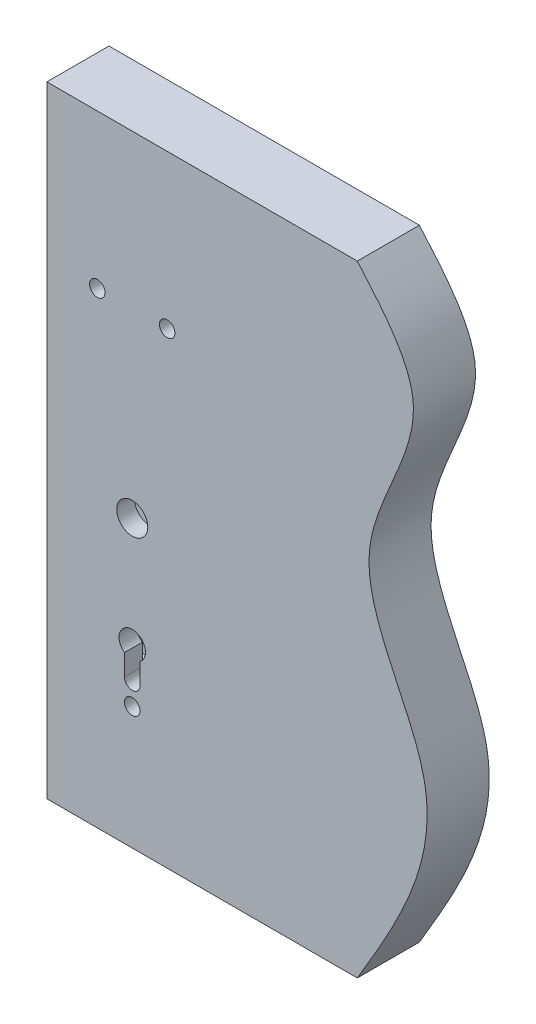
ISO-10303-21;
HEADER;
FILE_DESCRIPTION(('STEP AP214'),'2;1');
FILE_NAME('part.step','',(''),(''),'','','');
FILE_SCHEMA(('AUTOMOTIVE_DESIGN { 1 0 10303 214 1 1 1 1 }'));
ENDSEC;
DATA;
#1=APPLICATION_CONTEXT('core data for automotive mechanical design processes');
#2=APPLICATION_PROTOCOL_DEFINITION('international standard','automotive_design',2000,#1);
#3=PRODUCT_CONTEXT('',#1,'mechanical');
#4=PRODUCT('Part','Part','',(#3));
#5=PRODUCT_RELATED_PRODUCT_CATEGORY('part','',(#4));
#6=PRODUCT_DEFINITION_FORMATION('','',#4);
#7=PRODUCT_DEFINITION_CONTEXT('part definition',#1,'design');
#8=PRODUCT_DEFINITION('design','',#6,#7);
#9=PRODUCT_DEFINITION_SHAPE('','',#8);
#10=(LENGTH_UNIT() NAMED_UNIT(*) SI_UNIT(.MILLI.,.METRE.));
#11=(NAMED_UNIT(*) PLANE_ANGLE_UNIT() SI_UNIT($,.RADIAN.));
#12=(NAMED_UNIT(*) SI_UNIT($,.STERADIAN.) SOLID_ANGLE_UNIT());
#13=UNCERTAINTY_MEASURE_WITH_UNIT(LENGTH_MEASURE(1.E-05),#10,'distance_accuracy_value','');
#14=(GEOMETRIC_REPRESENTATION_CONTEXT(3) GLOBAL_UNCERTAINTY_ASSIGNED_CONTEXT((#13)) GLOBAL_UNIT_ASSIGNED_CONTEXT((#10,
#11,#12)) REPRESENTATION_CONTEXT('',''));
#15=CARTESIAN_POINT('',(0.,0.,0.));
#16=DIRECTION('',(0.,0.,1.));
#17=DIRECTION('',(1.,0.,0.));
#18=AXIS2_PLACEMENT_3D('',#15,#16,#17);
#19=CARTESIAN_POINT('',(-147.,-116.5,-8.5));
#20=DIRECTION('',(0.,-1.,0.));
#21=DIRECTION('',(1.,0.,0.));
#22=AXIS2_PLACEMENT_3D('',#19,#20,#21);
#23=PLANE('',#22);
#24=DIRECTION('',(1.,0.,0.));
#25=VECTOR('',#24,1.);
#26=CARTESIAN_POINT('',(-147.,-116.5,-8.5));
#27=LINE('',#26,#25);
#28=CARTESIAN_POINT('',(-92.8205505282296,-116.5,-8.5));
#29=VERTEX_POINT('',#28);
#30=CARTESIAN_POINT('',(-70.,-116.5,-8.5));
#31=VERTEX_POINT('',#30);
#32=EDGE_CURVE('E280',#29,#31,#27,.T.);
#33=ORIENTED_EDGE('',*,*,#32,.F.);
#34=DIRECTION('',(0.,0.,1.));
#35=VECTOR('',#34,1.);
#36=CARTESIAN_POINT('',(-92.8205505282296,-116.5,-20.));
#37=LINE('',#36,#35);
#38=CARTESIAN_POINT('',(-92.8205505282296,-116.5,8.5));
#39=VERTEX_POINT('',#38);
#40=EDGE_CURVE('E254',#29,#39,#37,.T.);
#41=ORIENTED_EDGE('',*,*,#40,.T.);
#42=DIRECTION('',(1.,0.,0.));
#43=VECTOR('',#42,1.);
#44=CARTESIAN_POINT('',(-147.,-116.5,8.5));
#45=LINE('',#44,#43);
#46=CARTESIAN_POINT('',(-70.,-116.5,8.5));
#47=VERTEX_POINT('',#46);
#48=EDGE_CURVE('E275',#39,#47,#45,.T.);
#49=ORIENTED_EDGE('',*,*,#48,.T.);
#50=DIRECTION('',(0.,0.,1.));
#51=VECTOR('',#50,1.);
#52=CARTESIAN_POINT('',(-70.,-116.5,-8.5));
#53=LINE('',#52,#51);
#54=EDGE_CURVE('E289',#31,#47,#53,.T.);
#55=ORIENTED_EDGE('',*,*,#54,.F.);
#56=EDGE_LOOP('',(#33,#41,#49,#55));
#57=FACE_BOUND('',#56,.T.);
#58=ADVANCED_FACE('F35',(#57),#23,.F.);
#59=CARTESIAN_POINT('',(-147.,-150.,-11.));
#60=DIRECTION('',(-1.,0.,0.));
#61=DIRECTION('',(0.,0.,1.));
#62=AXIS2_PLACEMENT_3D('',#59,#60,#61);
#63=PLANE('',#62);
#64=DIRECTION('',(0.,-1.,0.));
#65=VECTOR('',#64,1.);
#66=CARTESIAN_POINT('',(-147.,80.,-11.));
#67=LINE('',#66,#65);
#68=CARTESIAN_POINT('',(-147.,80.,-11.));
#69=VERTEX_POINT('',#68);
#70=CARTESIAN_POINT('',(-147.,-150.,-11.));
#71=VERTEX_POINT('',#70);
#72=EDGE_CURVE('E312',#69,#71,#67,.T.);
#73=ORIENTED_EDGE('',*,*,#72,.T.);
#74=DIRECTION('',(0.,0.,1.));
#75=VECTOR('',#74,1.);
#76=CARTESIAN_POINT('',(-147.,-150.,-11.));
#77=LINE('',#76,#75);
#78=CARTESIAN_POINT('',(-147.,-150.,11.));
#79=VERTEX_POINT('',#78);
#80=EDGE_CURVE('E315',#71,#79,#77,.T.);
#81=ORIENTED_EDGE('',*,*,#80,.T.);
#82=DIRECTION('',(0.,1.,0.));
#83=VECTOR('',#82,1.);
#84=CARTESIAN_POINT('',(-147.,80.,11.));
#85=LINE('',#84,#83);
#86=CARTESIAN_POINT('',(-147.,80.,11.));
#87=VERTEX_POINT('',#86);
#88=EDGE_CURVE('E319',#79,#87,#85,.T.);
#89=ORIENTED_EDGE('',*,*,#88,.T.);
#90=DIRECTION('',(0.,0.,-1.));
#91=VECTOR('',#90,1.);
#92=CARTESIAN_POINT('',(-147.,80.,-11.));
#93=LINE('',#92,#91);
#94=EDGE_CURVE('E322',#87,#69,#93,.T.);
#95=ORIENTED_EDGE('',*,*,#94,.T.);
#96=EDGE_LOOP('',(#73,#81,#89,#95));
#97=FACE_BOUND('',#96,.T.);
#98=DIRECTION('',(0.,0.,1.));
#99=VECTOR('',#98,1.);
#100=CARTESIAN_POINT('',(-147.,-116.5,-8.5));
#101=LINE('',#100,#99);
#102=CARTESIAN_POINT('',(-147.,-116.5,-8.5));
#103=VERTEX_POINT('',#102);
#104=CARTESIAN_POINT('',(-147.,-116.5,8.5));
#105=VERTEX_POINT('',#104);
#106=EDGE_CURVE('E301',#103,#105,#101,.T.);
#107=ORIENTED_EDGE('',*,*,#106,.F.);
#108=DIRECTION('',(0.,-1.,0.));
#109=VECTOR('',#108,1.);
#110=CARTESIAN_POINT('',(-147.,-116.5,-8.5));
#111=LINE('',#110,#109);
#112=CARTESIAN_POINT('',(-147.,46.5,-8.5));
#113=VERTEX_POINT('',#112);
#114=EDGE_CURVE('E286',#113,#103,#111,.T.);
#115=ORIENTED_EDGE('',*,*,#114,.F.);
#116=DIRECTION('',(0.,0.,1.));
#117=VECTOR('',#116,1.);
#118=CARTESIAN_POINT('',(-147.,46.5,-8.5));
#119=LINE('',#118,#117);
#120=CARTESIAN_POINT('',(-147.,46.5,8.5));
#121=VERTEX_POINT('',#120);
#122=EDGE_CURVE('E305',#113,#121,#119,.T.);
#123=ORIENTED_EDGE('',*,*,#122,.T.);
#124=DIRECTION('',(0.,-1.,0.));
#125=VECTOR('',#124,1.);
#126=CARTESIAN_POINT('',(-147.,-116.5,8.5));
#127=LINE('',#126,#125);
#128=EDGE_CURVE('E298',#121,#105,#127,.T.);
#129=ORIENTED_EDGE('',*,*,#128,.T.);
#130=EDGE_LOOP('',(#107,#115,#123,#129));
#131=FACE_BOUND('',#130,.T.);
#132=ADVANCED_FACE('F373',(#97,#131),#63,.T.);
#133=CARTESIAN_POINT('',(-150.,200.,20.));
#134=DIRECTION('',(1.,0.,0.));
#135=DIRECTION('',(0.,0.,-1.));
#136=AXIS2_PLACEMENT_3D('',#133,#134,#135);
#137=PLANE('',#136);
#138=DIRECTION('',(0.,0.,1.));
#139=VECTOR('',#138,1.);
#140=CARTESIAN_POINT('',(-150.,-150.,-11.));
#141=LINE('',#140,#139);
#142=CARTESIAN_POINT('',(-150.,-150.,-11.));
#143=VERTEX_POINT('',#142);
#144=CARTESIAN_POINT('',(-150.,-150.,11.));
#145=VERTEX_POINT('',#144);
#146=EDGE_CURVE('E327',#143,#145,#141,.T.);
#147=ORIENTED_EDGE('',*,*,#146,.F.);
#148=DIRECTION('',(0.,-1.,0.));
#149=VECTOR('',#148,1.);
#150=CARTESIAN_POINT('',(-150.,80.,-11.));
#151=LINE('',#150,#149);
#152=CARTESIAN_POINT('',(-150.,80.,-11.));
#153=VERTEX_POINT('',#152);
#154=EDGE_CURVE('E304',#153,#143,#151,.T.);
#155=ORIENTED_EDGE('',*,*,#154,.F.);
#156=DIRECTION('',(0.,0.,-1.));
#157=VECTOR('',#156,1.);
#158=CARTESIAN_POINT('',(-150.,80.,-11.));
#159=LINE('',#158,#157);
#160=CARTESIAN_POINT('',(-150.,80.,11.));
#161=VERTEX_POINT('',#160);
#162=EDGE_CURVE('E316',#161,#153,#159,.T.);
#163=ORIENTED_EDGE('',*,*,#162,.F.);
#164=DIRECTION('',(0.,1.,0.));
#165=VECTOR('',#164,1.);
#166=CARTESIAN_POINT('',(-150.,80.,11.));
#167=LINE('',#166,#165);
#168=EDGE_CURVE('E330',#145,#161,#167,.T.);
#169=ORIENTED_EDGE('',*,*,#168,.F.);
#170=EDGE_LOOP('',(#147,#155,#163,#169));
#171=FACE_BOUND('',#170,.T.);
#172=DIRECTION('',(0.,-1.,0.));
#173=VECTOR('',#172,1.);
#174=CARTESIAN_POINT('',(-150.,200.,-20.));
#175=LINE('',#174,#173);
#176=CARTESIAN_POINT('',(-150.,200.,-20.));
#177=VERTEX_POINT('',#176);
#178=CARTESIAN_POINT('',(-150.,-200.,-20.));
#179=VERTEX_POINT('',#178);
#180=EDGE_CURVE('E337',#177,#179,#175,.T.);
#181=ORIENTED_EDGE('',*,*,#180,.T.);
#182=DIRECTION('',(0.,0.,-1.));
#183=VECTOR('',#182,1.);
#184=CARTESIAN_POINT('',(-150.,-200.,20.));
#185=LINE('',#184,#183);
#186=CARTESIAN_POINT('',(-150.,-200.,20.));
#187=VERTEX_POINT('',#186);
#188=EDGE_CURVE('E411',#187,#179,#185,.T.);
#189=ORIENTED_EDGE('',*,*,#188,.F.);
#190=DIRECTION('',(0.,-1.,0.));
#191=VECTOR('',#190,1.);
#192=CARTESIAN_POINT('',(-150.,200.,20.));
#193=LINE('',#192,#191);
#194=CARTESIAN_POINT('',(-150.,200.,20.));
#195=VERTEX_POINT('',#194);
#196=EDGE_CURVE('E344',#195,#187,#193,.T.);
#197=ORIENTED_EDGE('',*,*,#196,.F.);
#198=DIRECTION('',(0.,0.,-1.));
#199=VECTOR('',#198,1.);
#200=CARTESIAN_POINT('',(-150.,200.,20.));
#201=LINE('',#200,#199);
#202=EDGE_CURVE('E491',#195,#177,#201,.T.);
#203=ORIENTED_EDGE('',*,*,#202,.T.);
#204=EDGE_LOOP('',(#181,#189,#197,#203));
#205=FACE_BOUND('',#204,.T.);
#206=ADVANCED_FACE('F37',(#171,#205),#137,.F.);
#207=CARTESIAN_POINT('',(-150.,-200.,20.));
#208=DIRECTION('',(0.,1.,0.));
#209=DIRECTION('',(0.,0.,1.));
#210=AXIS2_PLACEMENT_3D('',#207,#208,#209);
#211=PLANE('',#210);
#212=DIRECTION('',(1.,0.,0.));
#213=VECTOR('',#212,1.);
#214=CARTESIAN_POINT('',(-150.,-200.,-20.));
#215=LINE('',#214,#213);
#216=CARTESIAN_POINT('',(50.,-200.,-20.));
#217=VERTEX_POINT('',#216);
#218=EDGE_CURVE('E477',#179,#217,#215,.T.);
#219=ORIENTED_EDGE('',*,*,#218,.T.);
#220=DIRECTION('',(0.,0.,-1.));
#221=VECTOR('',#220,1.);
#222=CARTESIAN_POINT('',(50.,-200.,20.));
#223=LINE('',#222,#221);
#224=CARTESIAN_POINT('',(50.,-200.,20.));
#225=VERTEX_POINT('',#224);
#226=EDGE_CURVE('E416',#225,#217,#223,.T.);
#227=ORIENTED_EDGE('',*,*,#226,.F.);
#228=DIRECTION('',(1.,0.,0.));
#229=VECTOR('',#228,1.);
#230=CARTESIAN_POINT('',(-150.,-200.,20.));
#231=LINE('',#230,#229);
#232=EDGE_CURVE('E347',#187,#225,#231,.T.);
#233=ORIENTED_EDGE('',*,*,#232,.F.);
#234=ORIENTED_EDGE('',*,*,#188,.T.);
#235=EDGE_LOOP('',(#219,#227,#233,#234));
#236=FACE_BOUND('',#235,.T.);
#237=ADVANCED_FACE('F365',(#236),#211,.F.);
#238=CARTESIAN_POINT('',(50.,-200.,20.));
#239=CARTESIAN_POINT('',(75.8926121429316,-156.299492504264,20.));
#240=CARTESIAN_POINT('',(123.473848535243,-75.9937988901806,20.));
#241=CARTESIAN_POINT('',(27.2782564010871,35.2365570661427,20.));
#242=CARTESIAN_POINT('',(108.79400955081,132.296562906832,20.));
#243=CARTESIAN_POINT('',(66.8795606617927,180.562572919298,20.));
#244=CARTESIAN_POINT('',(50.,200.,20.));
#245=B_SPLINE_CURVE_WITH_KNOTS('',3,(#238,#239,#240,#241,#242,#243,#244),.UNSPECIFIED.,.F.,.F.,
(4,1,1,1,4),(0.,0.322833315670229,0.593250623900925,0.836196086314051,1.),.UNSPECIFIED.);
#246=DIRECTION('',(0.,0.,-1.));
#247=VECTOR('',#246,1.);
#248=SURFACE_OF_LINEAR_EXTRUSION('',#245,#247);
#249=CARTESIAN_POINT('',(50.,-200.,-20.));
#250=CARTESIAN_POINT('',(75.8926121429316,-156.299492504264,-20.));
#251=CARTESIAN_POINT('',(123.473848535243,-75.9937988901806,-20.));
#252=CARTESIAN_POINT('',(27.2782564010871,35.2365570661427,-20.));
#253=CARTESIAN_POINT('',(108.79400955081,132.296562906832,-20.));
#254=CARTESIAN_POINT('',(66.8795606617927,180.562572919298,-20.));
#255=CARTESIAN_POINT('',(50.,200.,-20.));
#256=B_SPLINE_CURVE_WITH_KNOTS('',3,(#249,#250,#251,#252,#253,#254,#255),.UNSPECIFIED.,.F.,.F.,
(4,1,1,1,4),(0.,0.322833315670229,0.593250623900925,0.836196086314051,1.),.UNSPECIFIED.);
#257=CARTESIAN_POINT('',(50.,200.,-20.));
#258=VERTEX_POINT('',#257);
#259=EDGE_CURVE('E481',#217,#258,#256,.T.);
#260=ORIENTED_EDGE('',*,*,#259,.T.);
#261=DIRECTION('',(0.,0.,-1.));
#262=VECTOR('',#261,1.);
#263=CARTESIAN_POINT('',(50.,200.,20.));
#264=LINE('',#263,#262);
#265=CARTESIAN_POINT('',(50.,200.,20.));
#266=VERTEX_POINT('',#265);
#267=EDGE_CURVE('E493',#266,#258,#264,.T.);
#268=ORIENTED_EDGE('',*,*,#267,.F.);
#269=EDGE_CURVE('E350',#225,#266,#245,.T.);
#270=ORIENTED_EDGE('',*,*,#269,.F.);
#271=ORIENTED_EDGE('',*,*,#226,.T.);
#272=EDGE_LOOP('',(#260,#268,#270,#271));
#273=FACE_BOUND('',#272,.T.);
#274=ADVANCED_FACE('F361',(#273),#248,.F.);
#275=CARTESIAN_POINT('',(-150.,200.,20.));
#276=DIRECTION('',(0.,-1.,0.));
#277=DIRECTION('',(0.,0.,-1.));
#278=AXIS2_PLACEMENT_3D('',#275,#276,#277);
#279=PLANE('',#278);
#280=DIRECTION('',(-1.,0.,0.));
#281=VECTOR('',#280,1.);
#282=CARTESIAN_POINT('',(-150.,200.,-20.));
#283=LINE('',#282,#281);
#284=EDGE_CURVE('E348',#258,#177,#283,.T.);
#285=ORIENTED_EDGE('',*,*,#284,.T.);
#286=ORIENTED_EDGE('',*,*,#202,.F.);
#287=DIRECTION('',(-1.,0.,0.));
#288=VECTOR('',#287,1.);
#289=CARTESIAN_POINT('',(-150.,200.,20.));
#290=LINE('',#289,#288);
#291=EDGE_CURVE('E355',#266,#195,#290,.T.);
#292=ORIENTED_EDGE('',*,*,#291,.F.);
#293=ORIENTED_EDGE('',*,*,#267,.T.);
#294=EDGE_LOOP('',(#285,#286,#292,#293));
#295=FACE_BOUND('',#294,.T.);
#296=ADVANCED_FACE('F364',(#295),#279,.F.);
#297=CARTESIAN_POINT('',(64.7438582512238,2.07966306238673,20.));
#298=DIRECTION('',(0.,0.,1.));
#299=DIRECTION('',(1.,0.,0.));
#300=AXIS2_PLACEMENT_3D('',#297,#298,#299);
#301=PLANE('',#300);
#302=CARTESIAN_POINT('',(-95.000000000001,-107.,20.));
#303=DIRECTION('',(0.,0.,-1.));
#304=DIRECTION('',(-1.,0.,0.));
#305=AXIS2_PLACEMENT_3D('',#302,#303,#304);
#306=CIRCLE('',#305,5.00000000000001);
#307=CARTESIAN_POINT('',(-90.000000000001,-107.,20.));
#308=VERTEX_POINT('',#307);
#309=CARTESIAN_POINT('',(-100.000000000001,-107.,20.));
#310=VERTEX_POINT('',#309);
#311=EDGE_CURVE('E191',#308,#310,#306,.T.);
#312=ORIENTED_EDGE('',*,*,#311,.T.);
#313=DIRECTION('',(0.,1.,0.));
#314=VECTOR('',#313,1.);
#315=CARTESIAN_POINT('',(-100.000000000001,-107.,20.));
#316=LINE('',#315,#314);
#317=CARTESIAN_POINT('',(-100.000000000001,-93.3738635424337,20.));
#318=VERTEX_POINT('',#317);
#319=EDGE_CURVE('E199',#310,#318,#316,.T.);
#320=ORIENTED_EDGE('',*,*,#319,.T.);
#321=CARTESIAN_POINT('',(-95.000000000001,-86.5,20.));
#322=DIRECTION('',(0.,0.,-1.));
#323=DIRECTION('',(-1.,0.,0.));
#324=AXIS2_PLACEMENT_3D('',#321,#322,#323);
#325=CIRCLE('',#324,8.50000000000001);
#326=CARTESIAN_POINT('',(-90.000000000001,-93.3738635424337,20.));
#327=VERTEX_POINT('',#326);
#328=EDGE_CURVE('E50',#318,#327,#325,.T.);
#329=ORIENTED_EDGE('',*,*,#328,.T.);
#330=DIRECTION('',(0.,-1.,0.));
#331=VECTOR('',#330,1.);
#332=CARTESIAN_POINT('',(-90.000000000001,-93.3738635424337,20.));
#333=LINE('',#332,#331);
#334=EDGE_CURVE('E207',#327,#308,#333,.T.);
#335=ORIENTED_EDGE('',*,*,#334,.T.);
#336=EDGE_LOOP('',(#312,#320,#329,#335));
#337=FACE_BOUND('',#336,.T.);
#338=CARTESIAN_POINT('',(-72.5,101.,20.));
#339=DIRECTION('',(0.,0.,1.));
#340=DIRECTION('',(1.,0.,0.));
#341=AXIS2_PLACEMENT_3D('',#338,#339,#340);
#342=CIRCLE('',#341,5.00000000000001);
#343=CARTESIAN_POINT('',(-67.5,101.,20.));
#344=VERTEX_POINT('',#343);
#345=EDGE_CURVE('E239',#344,#344,#342,.T.);
#346=ORIENTED_EDGE('',*,*,#345,.F.);
#347=EDGE_LOOP('',(#346));
#348=FACE_BOUND('',#347,.T.);
#349=CARTESIAN_POINT('',(-95.,-121.,20.));
#350=DIRECTION('',(0.,0.,1.));
#351=DIRECTION('',(1.,0.,0.));
#352=AXIS2_PLACEMENT_3D('',#349,#350,#351);
#353=CIRCLE('',#352,5.00000000000001);
#354=CARTESIAN_POINT('',(-90.,-121.,20.));
#355=VERTEX_POINT('',#354);
#356=EDGE_CURVE('E243',#355,#355,#353,.T.);
#357=ORIENTED_EDGE('',*,*,#356,.F.);
#358=EDGE_LOOP('',(#357));
#359=FACE_BOUND('',#358,.T.);
#360=CARTESIAN_POINT('',(-117.5,101.,20.));
#361=DIRECTION('',(0.,0.,1.));
#362=DIRECTION('',(1.,0.,0.));
#363=AXIS2_PLACEMENT_3D('',#360,#361,#362);
#364=CIRCLE('',#363,5.00000000000001);
#365=CARTESIAN_POINT('',(-112.5,101.,20.));
#366=VERTEX_POINT('',#365);
#367=EDGE_CURVE('E259',#366,#366,#364,.T.);
#368=ORIENTED_EDGE('',*,*,#367,.F.);
#369=EDGE_LOOP('',(#368));
#370=FACE_BOUND('',#369,.T.);
#371=CARTESIAN_POINT('',(-95.,-16.,20.));
#372=DIRECTION('',(0.,0.,1.));
#373=DIRECTION('',(1.,0.,0.));
#374=AXIS2_PLACEMENT_3D('',#371,#372,#373);
#375=CIRCLE('',#374,9.99999999999999);
#376=CARTESIAN_POINT('',(-85.,-16.,20.));
#377=VERTEX_POINT('',#376);
#378=EDGE_CURVE('E263',#377,#377,#375,.T.);
#379=ORIENTED_EDGE('',*,*,#378,.F.);
#380=EDGE_LOOP('',(#379));
#381=FACE_BOUND('',#380,.T.);
#382=ORIENTED_EDGE('',*,*,#196,.T.);
#383=ORIENTED_EDGE('',*,*,#232,.T.);
#384=ORIENTED_EDGE('',*,*,#269,.T.);
#385=ORIENTED_EDGE('',*,*,#291,.T.);
#386=EDGE_LOOP('',(#382,#383,#384,#385));
#387=FACE_BOUND('',#386,.T.);
#388=ADVANCED_FACE('F204',(#337,#348,#359,#370,#381,#387),#301,.T.);
#389=CARTESIAN_POINT('',(64.7438582512238,2.07966306238673,-20.));
#390=DIRECTION('',(0.,0.,1.));
#391=DIRECTION('',(1.,0.,0.));
#392=AXIS2_PLACEMENT_3D('',#389,#390,#391);
#393=PLANE('',#392);
#394=DIRECTION('',(0.,1.,0.));
#395=VECTOR('',#394,1.);
#396=CARTESIAN_POINT('',(-100.000000000001,-107.,-20.));
#397=LINE('',#396,#395);
#398=CARTESIAN_POINT('',(-100.000000000001,-107.,-20.));
#399=VERTEX_POINT('',#398);
#400=CARTESIAN_POINT('',(-100.000000000001,-93.3738635424337,-20.));
#401=VERTEX_POINT('',#400);
#402=EDGE_CURVE('E217',#399,#401,#397,.T.);
#403=ORIENTED_EDGE('',*,*,#402,.F.);
#404=CARTESIAN_POINT('',(-95.000000000001,-107.,-20.));
#405=DIRECTION('',(0.,0.,-1.));
#406=DIRECTION('',(-1.,0.,0.));
#407=AXIS2_PLACEMENT_3D('',#404,#405,#406);
#408=CIRCLE('',#407,5.00000000000001);
#409=CARTESIAN_POINT('',(-90.000000000001,-107.,-20.));
#410=VERTEX_POINT('',#409);
#411=EDGE_CURVE('E58',#410,#399,#408,.T.);
#412=ORIENTED_EDGE('',*,*,#411,.F.);
#413=DIRECTION('',(0.,-1.,0.));
#414=VECTOR('',#413,1.);
#415=CARTESIAN_POINT('',(-90.000000000001,-93.3738635424337,-20.));
#416=LINE('',#415,#414);
#417=CARTESIAN_POINT('',(-90.000000000001,-93.3738635424337,-20.));
#418=VERTEX_POINT('',#417);
#419=EDGE_CURVE('E208',#418,#410,#416,.T.);
#420=ORIENTED_EDGE('',*,*,#419,.F.);
#421=CARTESIAN_POINT('',(-95.000000000001,-86.5,-20.));
#422=DIRECTION('',(0.,0.,-1.));
#423=DIRECTION('',(-1.,0.,0.));
#424=AXIS2_PLACEMENT_3D('',#421,#422,#423);
#425=CIRCLE('',#424,8.50000000000001);
#426=EDGE_CURVE('E211',#401,#418,#425,.T.);
#427=ORIENTED_EDGE('',*,*,#426,.F.);
#428=EDGE_LOOP('',(#403,#412,#420,#427));
#429=FACE_BOUND('',#428,.T.);
#430=CARTESIAN_POINT('',(-72.5,101.,-20.));
#431=DIRECTION('',(0.,0.,1.));
#432=DIRECTION('',(1.,0.,0.));
#433=AXIS2_PLACEMENT_3D('',#430,#431,#432);
#434=CIRCLE('',#433,5.00000000000001);
#435=CARTESIAN_POINT('',(-67.5,101.,-20.));
#436=VERTEX_POINT('',#435);
#437=EDGE_CURVE('E240',#436,#436,#434,.T.);
#438=ORIENTED_EDGE('',*,*,#437,.T.);
#439=EDGE_LOOP('',(#438));
#440=FACE_BOUND('',#439,.T.);
#441=CARTESIAN_POINT('',(-95.,-121.,-20.));
#442=DIRECTION('',(0.,0.,1.));
#443=DIRECTION('',(1.,0.,0.));
#444=AXIS2_PLACEMENT_3D('',#441,#442,#443);
#445=CIRCLE('',#444,5.00000000000001);
#446=CARTESIAN_POINT('',(-90.,-121.,-20.));
#447=VERTEX_POINT('',#446);
#448=EDGE_CURVE('E246',#447,#447,#445,.T.);
#449=ORIENTED_EDGE('',*,*,#448,.T.);
#450=EDGE_LOOP('',(#449));
#451=FACE_BOUND('',#450,.T.);
#452=CARTESIAN_POINT('',(-117.5,101.,-20.));
#453=DIRECTION('',(0.,0.,1.));
#454=DIRECTION('',(1.,0.,0.));
#455=AXIS2_PLACEMENT_3D('',#452,#453,#454);
#456=CIRCLE('',#455,5.00000000000001);
#457=CARTESIAN_POINT('',(-112.5,101.,-20.));
#458=VERTEX_POINT('',#457);
#459=EDGE_CURVE('E260',#458,#458,#456,.T.);
#460=ORIENTED_EDGE('',*,*,#459,.T.);
#461=EDGE_LOOP('',(#460));
#462=FACE_BOUND('',#461,.T.);
#463=CARTESIAN_POINT('',(-95.,-16.,-20.));
#464=DIRECTION('',(0.,0.,1.));
#465=DIRECTION('',(1.,0.,0.));
#466=AXIS2_PLACEMENT_3D('',#463,#464,#465);
#467=CIRCLE('',#466,9.99999999999999);
#468=CARTESIAN_POINT('',(-85.,-16.,-20.));
#469=VERTEX_POINT('',#468);
#470=EDGE_CURVE('E266',#469,#469,#467,.T.);
#471=ORIENTED_EDGE('',*,*,#470,.T.);
#472=EDGE_LOOP('',(#471));
#473=FACE_BOUND('',#472,.T.);
#474=ORIENTED_EDGE('',*,*,#180,.F.);
#475=ORIENTED_EDGE('',*,*,#284,.F.);
#476=ORIENTED_EDGE('',*,*,#259,.F.);
#477=ORIENTED_EDGE('',*,*,#218,.F.);
#478=EDGE_LOOP('',(#474,#475,#476,#477));
#479=FACE_BOUND('',#478,.T.);
#480=ADVANCED_FACE('F461',(#429,#440,#451,#462,#473,#479),#393,.F.);
#481=CARTESIAN_POINT('',(-147.,80.,-11.));
#482=DIRECTION('',(0.,0.,-1.));
#483=DIRECTION('',(0.,1.,0.));
#484=AXIS2_PLACEMENT_3D('',#481,#482,#483);
#485=PLANE('',#484);
#486=ORIENTED_EDGE('',*,*,#154,.T.);
#487=DIRECTION('',(-1.,0.,0.));
#488=VECTOR('',#487,1.);
#489=CARTESIAN_POINT('',(-147.,-150.,-11.));
#490=LINE('',#489,#488);
#491=EDGE_CURVE('E325',#71,#143,#490,.T.);
#492=ORIENTED_EDGE('',*,*,#491,.F.);
#493=ORIENTED_EDGE('',*,*,#72,.F.);
#494=DIRECTION('',(-1.,0.,0.));
#495=VECTOR('',#494,1.);
#496=CARTESIAN_POINT('',(-147.,80.,-11.));
#497=LINE('',#496,#495);
#498=EDGE_CURVE('E335',#69,#153,#497,.T.);
#499=ORIENTED_EDGE('',*,*,#498,.T.);
#500=EDGE_LOOP('',(#486,#492,#493,#499));
#501=FACE_BOUND('',#500,.T.);
#502=ADVANCED_FACE('F464',(#501),#485,.F.);
#503=CARTESIAN_POINT('',(-147.,80.,-11.));
#504=DIRECTION('',(0.,1.,0.));
#505=DIRECTION('',(-1.,0.,0.));
#506=AXIS2_PLACEMENT_3D('',#503,#504,#505);
#507=PLANE('',#506);
#508=ORIENTED_EDGE('',*,*,#162,.T.);
#509=ORIENTED_EDGE('',*,*,#498,.F.);
#510=ORIENTED_EDGE('',*,*,#94,.F.);
#511=DIRECTION('',(-1.,0.,0.));
#512=VECTOR('',#511,1.);
#513=CARTESIAN_POINT('',(-147.,80.,11.));
#514=LINE('',#513,#512);
#515=EDGE_CURVE('E338',#87,#161,#514,.T.);
#516=ORIENTED_EDGE('',*,*,#515,.T.);
#517=EDGE_LOOP('',(#508,#509,#510,#516));
#518=FACE_BOUND('',#517,.T.);
#519=ADVANCED_FACE('F514',(#518),#507,.F.);
#520=CARTESIAN_POINT('',(-147.,80.,11.));
#521=DIRECTION('',(0.,0.,1.));
#522=DIRECTION('',(0.,-1.,0.));
#523=AXIS2_PLACEMENT_3D('',#520,#521,#522);
#524=PLANE('',#523);
#525=ORIENTED_EDGE('',*,*,#168,.T.);
#526=ORIENTED_EDGE('',*,*,#515,.F.);
#527=ORIENTED_EDGE('',*,*,#88,.F.);
#528=DIRECTION('',(-1.,0.,0.));
#529=VECTOR('',#528,1.);
#530=CARTESIAN_POINT('',(-147.,-150.,11.));
#531=LINE('',#530,#529);
#532=EDGE_CURVE('E340',#79,#145,#531,.T.);
#533=ORIENTED_EDGE('',*,*,#532,.T.);
#534=EDGE_LOOP('',(#525,#526,#527,#533));
#535=FACE_BOUND('',#534,.T.);
#536=ADVANCED_FACE('F397',(#535),#524,.F.);
#537=CARTESIAN_POINT('',(-147.,-150.,-11.));
#538=DIRECTION('',(0.,-1.,0.));
#539=DIRECTION('',(1.,0.,0.));
#540=AXIS2_PLACEMENT_3D('',#537,#538,#539);
#541=PLANE('',#540);
#542=ORIENTED_EDGE('',*,*,#146,.T.);
#543=ORIENTED_EDGE('',*,*,#532,.F.);
#544=ORIENTED_EDGE('',*,*,#80,.F.);
#545=ORIENTED_EDGE('',*,*,#491,.T.);
#546=EDGE_LOOP('',(#542,#543,#544,#545));
#547=FACE_BOUND('',#546,.T.);
#548=ADVANCED_FACE('F388',(#547),#541,.F.);
#549=CARTESIAN_POINT('',(-97.1794494717704,-116.5,8.5));
#550=VERTEX_POINT('',#549);
#551=EDGE_CURVE('E290',#105,#550,#45,.T.);
#552=ORIENTED_EDGE('',*,*,#551,.T.);
#553=DIRECTION('',(0.,0.,1.));
#554=VECTOR('',#553,1.);
#555=CARTESIAN_POINT('',(-97.1794494717704,-116.5,-20.));
#556=LINE('',#555,#554);
#557=CARTESIAN_POINT('',(-97.1794494717704,-116.5,-8.5));
#558=VERTEX_POINT('',#557);
#559=EDGE_CURVE('E249',#550,#558,#556,.F.);
#560=ORIENTED_EDGE('',*,*,#559,.T.);
#561=EDGE_CURVE('E276',#103,#558,#27,.T.);
#562=ORIENTED_EDGE('',*,*,#561,.F.);
#563=ORIENTED_EDGE('',*,*,#106,.T.);
#564=EDGE_LOOP('',(#552,#560,#562,#563));
#565=FACE_BOUND('',#564,.T.);
#566=ADVANCED_FACE('F378',(#565),#23,.F.);
#567=CARTESIAN_POINT('',(-147.,46.5,-8.5));
#568=DIRECTION('',(0.,1.,0.));
#569=DIRECTION('',(-1.,0.,0.));
#570=AXIS2_PLACEMENT_3D('',#567,#568,#569);
#571=PLANE('',#570);
#572=DIRECTION('',(-1.,0.,0.));
#573=VECTOR('',#572,1.);
#574=CARTESIAN_POINT('',(-147.,46.5,8.5));
#575=LINE('',#574,#573);
#576=CARTESIAN_POINT('',(-70.,46.5,8.5));
#577=VERTEX_POINT('',#576);
#578=EDGE_CURVE('E296',#577,#121,#575,.T.);
#579=ORIENTED_EDGE('',*,*,#578,.T.);
#580=ORIENTED_EDGE('',*,*,#122,.F.);
#581=DIRECTION('',(-1.,0.,0.));
#582=VECTOR('',#581,1.);
#583=CARTESIAN_POINT('',(-147.,46.5,-8.5));
#584=LINE('',#583,#582);
#585=CARTESIAN_POINT('',(-70.,46.5,-8.5));
#586=VERTEX_POINT('',#585);
#587=EDGE_CURVE('E283',#586,#113,#584,.T.);
#588=ORIENTED_EDGE('',*,*,#587,.F.);
#589=DIRECTION('',(0.,0.,1.));
#590=VECTOR('',#589,1.);
#591=CARTESIAN_POINT('',(-70.,46.5,-8.5));
#592=LINE('',#591,#590);
#593=EDGE_CURVE('E308',#586,#577,#592,.T.);
#594=ORIENTED_EDGE('',*,*,#593,.T.);
#595=EDGE_LOOP('',(#579,#580,#588,#594));
#596=FACE_BOUND('',#595,.T.);
#597=ADVANCED_FACE('F387',(#596),#571,.F.);
#598=CARTESIAN_POINT('',(-70.,-116.5,-8.5));
#599=DIRECTION('',(1.,0.,0.));
#600=DIRECTION('',(0.,0.,-1.));
#601=AXIS2_PLACEMENT_3D('',#598,#599,#600);
#602=PLANE('',#601);
#603=DIRECTION('',(0.,1.,0.));
#604=VECTOR('',#603,1.);
#605=CARTESIAN_POINT('',(-70.,-116.5,8.5));
#606=LINE('',#605,#604);
#607=EDGE_CURVE('E293',#47,#577,#606,.T.);
#608=ORIENTED_EDGE('',*,*,#607,.T.);
#609=ORIENTED_EDGE('',*,*,#593,.F.);
#610=DIRECTION('',(0.,1.,0.));
#611=VECTOR('',#610,1.);
#612=CARTESIAN_POINT('',(-70.,-116.5,-8.5));
#613=LINE('',#612,#611);
#614=EDGE_CURVE('E279',#31,#586,#613,.T.);
#615=ORIENTED_EDGE('',*,*,#614,.F.);
#616=ORIENTED_EDGE('',*,*,#54,.T.);
#617=EDGE_LOOP('',(#608,#609,#615,#616));
#618=FACE_BOUND('',#617,.T.);
#619=ADVANCED_FACE('F394',(#618),#602,.F.);
#620=CARTESIAN_POINT('',(-70.,-116.5,-8.5));
#621=DIRECTION('',(0.,0.,1.));
#622=DIRECTION('',(1.,0.,0.));
#623=AXIS2_PLACEMENT_3D('',#620,#621,#622);
#624=PLANE('',#623);
#625=CARTESIAN_POINT('',(-95.000000000001,-107.,-8.5));
#626=DIRECTION('',(0.,0.,1.));
#627=DIRECTION('',(1.,0.,0.));
#628=AXIS2_PLACEMENT_3D('',#625,#626,#627);
#629=CIRCLE('',#628,5.00000000000001);
#630=CARTESIAN_POINT('',(-100.000000000001,-107.,-8.5));
#631=VERTEX_POINT('',#630);
#632=CARTESIAN_POINT('',(-90.000000000001,-107.,-8.5));
#633=VERTEX_POINT('',#632);
#634=EDGE_CURVE('E237',#631,#633,#629,.T.);
#635=ORIENTED_EDGE('',*,*,#634,.F.);
#636=DIRECTION('',(0.,-1.,0.));
#637=VECTOR('',#636,1.);
#638=CARTESIAN_POINT('',(-100.000000000001,-116.5,-8.5));
#639=LINE('',#638,#637);
#640=CARTESIAN_POINT('',(-100.000000000001,-93.3738635424337,-8.5));
#641=VERTEX_POINT('',#640);
#642=EDGE_CURVE('E224',#641,#631,#639,.T.);
#643=ORIENTED_EDGE('',*,*,#642,.F.);
#644=CARTESIAN_POINT('',(-95.000000000001,-86.5,-8.5));
#645=DIRECTION('',(0.,0.,1.));
#646=DIRECTION('',(1.,0.,0.));
#647=AXIS2_PLACEMENT_3D('',#644,#645,#646);
#648=CIRCLE('',#647,8.50000000000001);
#649=CARTESIAN_POINT('',(-90.000000000001,-93.3738635424337,-8.5));
#650=VERTEX_POINT('',#649);
#651=EDGE_CURVE('E232',#650,#641,#648,.T.);
#652=ORIENTED_EDGE('',*,*,#651,.F.);
#653=DIRECTION('',(0.,1.,0.));
#654=VECTOR('',#653,1.);
#655=CARTESIAN_POINT('',(-90.000000000001,-116.5,-8.5));
#656=LINE('',#655,#654);
#657=EDGE_CURVE('E235',#633,#650,#656,.T.);
#658=ORIENTED_EDGE('',*,*,#657,.F.);
#659=EDGE_LOOP('',(#635,#643,#652,#658));
#660=FACE_BOUND('',#659,.T.);
#661=CARTESIAN_POINT('',(-95.,-121.,-8.5));
#662=DIRECTION('',(0.,0.,1.));
#663=DIRECTION('',(1.,0.,0.));
#664=AXIS2_PLACEMENT_3D('',#661,#662,#663);
#665=CIRCLE('',#664,5.00000000000001);
#666=EDGE_CURVE('E257',#29,#558,#665,.T.);
#667=ORIENTED_EDGE('',*,*,#666,.F.);
#668=ORIENTED_EDGE('',*,*,#32,.T.);
#669=ORIENTED_EDGE('',*,*,#614,.T.);
#670=ORIENTED_EDGE('',*,*,#587,.T.);
#671=ORIENTED_EDGE('',*,*,#114,.T.);
#672=ORIENTED_EDGE('',*,*,#561,.T.);
#673=EDGE_LOOP('',(#667,#668,#669,#670,#671,#672));
#674=FACE_BOUND('',#673,.T.);
#675=CARTESIAN_POINT('',(-95.,-16.,-8.5));
#676=DIRECTION('',(0.,0.,1.));
#677=DIRECTION('',(1.,0.,0.));
#678=AXIS2_PLACEMENT_3D('',#675,#676,#677);
#679=CIRCLE('',#678,9.99999999999999);
#680=CARTESIAN_POINT('',(-85.,-16.,-8.5));
#681=VERTEX_POINT('',#680);
#682=EDGE_CURVE('E272',#681,#681,#679,.T.);
#683=ORIENTED_EDGE('',*,*,#682,.F.);
#684=EDGE_LOOP('',(#683));
#685=FACE_BOUND('',#684,.T.);
#686=ADVANCED_FACE('F454',(#660,#674,#685),#624,.T.);
#687=CARTESIAN_POINT('',(-70.,-116.5,8.5));
#688=DIRECTION('',(0.,0.,1.));
#689=DIRECTION('',(1.,0.,0.));
#690=AXIS2_PLACEMENT_3D('',#687,#688,#689);
#691=PLANE('',#690);
#692=DIRECTION('',(0.,-1.,0.));
#693=VECTOR('',#692,1.);
#694=CARTESIAN_POINT('',(-100.000000000001,-116.5,8.5));
#695=LINE('',#694,#693);
#696=CARTESIAN_POINT('',(-100.000000000001,-93.3738635424337,8.5));
#697=VERTEX_POINT('',#696);
#698=CARTESIAN_POINT('',(-100.000000000001,-107.,8.5));
#699=VERTEX_POINT('',#698);
#700=EDGE_CURVE('E410',#697,#699,#695,.T.);
#701=ORIENTED_EDGE('',*,*,#700,.T.);
#702=CARTESIAN_POINT('',(-95.000000000001,-107.,8.5));
#703=DIRECTION('',(0.,0.,1.));
#704=DIRECTION('',(1.,0.,0.));
#705=AXIS2_PLACEMENT_3D('',#702,#703,#704);
#706=CIRCLE('',#705,5.00000000000001);
#707=CARTESIAN_POINT('',(-90.000000000001,-107.,8.5));
#708=VERTEX_POINT('',#707);
#709=EDGE_CURVE('E11',#699,#708,#706,.T.);
#710=ORIENTED_EDGE('',*,*,#709,.T.);
#711=DIRECTION('',(0.,1.,0.));
#712=VECTOR('',#711,1.);
#713=CARTESIAN_POINT('',(-90.000000000001,-116.5,8.5));
#714=LINE('',#713,#712);
#715=CARTESIAN_POINT('',(-90.000000000001,-93.3738635424337,8.5));
#716=VERTEX_POINT('',#715);
#717=EDGE_CURVE('E43',#708,#716,#714,.T.);
#718=ORIENTED_EDGE('',*,*,#717,.T.);
#719=CARTESIAN_POINT('',(-95.000000000001,-86.5,8.5));
#720=DIRECTION('',(0.,0.,1.));
#721=DIRECTION('',(1.,0.,0.));
#722=AXIS2_PLACEMENT_3D('',#719,#720,#721);
#723=CIRCLE('',#722,8.50000000000001);
#724=EDGE_CURVE('E413',#716,#697,#723,.T.);
#725=ORIENTED_EDGE('',*,*,#724,.T.);
#726=EDGE_LOOP('',(#701,#710,#718,#725));
#727=FACE_BOUND('',#726,.T.);
#728=CARTESIAN_POINT('',(-95.,-16.,8.5));
#729=DIRECTION('',(0.,0.,1.));
#730=DIRECTION('',(1.,0.,0.));
#731=AXIS2_PLACEMENT_3D('',#728,#729,#730);
#732=CIRCLE('',#731,9.99999999999999);
#733=CARTESIAN_POINT('',(-85.,-16.,8.5));
#734=VERTEX_POINT('',#733);
#735=EDGE_CURVE('E269',#734,#734,#732,.T.);
#736=ORIENTED_EDGE('',*,*,#735,.T.);
#737=EDGE_LOOP('',(#736));
#738=FACE_BOUND('',#737,.T.);
#739=ORIENTED_EDGE('',*,*,#48,.F.);
#740=CARTESIAN_POINT('',(-95.,-121.,8.5));
#741=DIRECTION('',(0.,0.,1.));
#742=DIRECTION('',(1.,0.,0.));
#743=AXIS2_PLACEMENT_3D('',#740,#741,#742);
#744=CIRCLE('',#743,5.00000000000001);
#745=EDGE_CURVE('E407',#39,#550,#744,.T.);
#746=ORIENTED_EDGE('',*,*,#745,.T.);
#747=ORIENTED_EDGE('',*,*,#551,.F.);
#748=ORIENTED_EDGE('',*,*,#128,.F.);
#749=ORIENTED_EDGE('',*,*,#578,.F.);
#750=ORIENTED_EDGE('',*,*,#607,.F.);
#751=EDGE_LOOP('',(#739,#746,#747,#748,#749,#750));
#752=FACE_BOUND('',#751,.T.);
#753=ADVANCED_FACE('F405',(#727,#738,#752),#691,.F.);
#754=CARTESIAN_POINT('',(-95.,-16.,-20.));
#755=DIRECTION('',(0.,0.,1.));
#756=DIRECTION('',(1.,0.,0.));
#757=AXIS2_PLACEMENT_3D('',#754,#755,#756);
#758=CYLINDRICAL_SURFACE('',#757,9.99999999999999);
#759=ORIENTED_EDGE('',*,*,#378,.T.);
#760=EDGE_LOOP('',(#759));
#761=FACE_BOUND('',#760,.T.);
#762=ORIENTED_EDGE('',*,*,#735,.F.);
#763=EDGE_LOOP('',(#762));
#764=FACE_BOUND('',#763,.T.);
#765=ADVANCED_FACE('F553',(#761,#764),#758,.F.);
#766=ORIENTED_EDGE('',*,*,#682,.T.);
#767=EDGE_LOOP('',(#766));
#768=FACE_BOUND('',#767,.T.);
#769=ORIENTED_EDGE('',*,*,#470,.F.);
#770=EDGE_LOOP('',(#769));
#771=FACE_BOUND('',#770,.T.);
#772=ADVANCED_FACE('F556',(#768,#771),#758,.F.);
#773=CARTESIAN_POINT('',(-117.5,101.,-20.));
#774=DIRECTION('',(0.,0.,1.));
#775=DIRECTION('',(1.,0.,0.));
#776=AXIS2_PLACEMENT_3D('',#773,#774,#775);
#777=CYLINDRICAL_SURFACE('',#776,5.00000000000001);
#778=ORIENTED_EDGE('',*,*,#459,.F.);
#779=EDGE_LOOP('',(#778));
#780=FACE_BOUND('',#779,.T.);
#781=ORIENTED_EDGE('',*,*,#367,.T.);
#782=EDGE_LOOP('',(#781));
#783=FACE_BOUND('',#782,.T.);
#784=ADVANCED_FACE('F543',(#780,#783),#777,.F.);
#785=CARTESIAN_POINT('',(-95.,-121.,-20.));
#786=DIRECTION('',(0.,0.,1.));
#787=DIRECTION('',(1.,0.,0.));
#788=AXIS2_PLACEMENT_3D('',#785,#786,#787);
#789=CYLINDRICAL_SURFACE('',#788,5.00000000000001);
#790=ORIENTED_EDGE('',*,*,#666,.T.);
#791=ORIENTED_EDGE('',*,*,#559,.F.);
#792=ORIENTED_EDGE('',*,*,#745,.F.);
#793=ORIENTED_EDGE('',*,*,#40,.F.);
#794=EDGE_LOOP('',(#790,#791,#792,#793));
#795=FACE_BOUND('',#794,.T.);
#796=ORIENTED_EDGE('',*,*,#448,.F.);
#797=EDGE_LOOP('',(#796));
#798=FACE_BOUND('',#797,.T.);
#799=ORIENTED_EDGE('',*,*,#356,.T.);
#800=EDGE_LOOP('',(#799));
#801=FACE_BOUND('',#800,.T.);
#802=ADVANCED_FACE('F540',(#795,#798,#801),#789,.F.);
#803=CARTESIAN_POINT('',(-72.5,101.,-20.));
#804=DIRECTION('',(0.,0.,1.));
#805=DIRECTION('',(1.,0.,0.));
#806=AXIS2_PLACEMENT_3D('',#803,#804,#805);
#807=CYLINDRICAL_SURFACE('',#806,5.00000000000001);
#808=ORIENTED_EDGE('',*,*,#437,.F.);
#809=EDGE_LOOP('',(#808));
#810=FACE_BOUND('',#809,.T.);
#811=ORIENTED_EDGE('',*,*,#345,.T.);
#812=EDGE_LOOP('',(#811));
#813=FACE_BOUND('',#812,.T.);
#814=ADVANCED_FACE('F436',(#810,#813),#807,.F.);
#815=CARTESIAN_POINT('',(-100.000000000001,-107.,20.));
#816=DIRECTION('',(-1.,0.,0.));
#817=DIRECTION('',(0.,0.,1.));
#818=AXIS2_PLACEMENT_3D('',#815,#816,#817);
#819=PLANE('',#818);
#820=DIRECTION('',(0.,0.,-1.));
#821=VECTOR('',#820,1.);
#822=CARTESIAN_POINT('',(-100.000000000001,-93.3738635424337,20.));
#823=LINE('',#822,#821);
#824=EDGE_CURVE('E201',#318,#697,#823,.T.);
#825=ORIENTED_EDGE('',*,*,#824,.F.);
#826=ORIENTED_EDGE('',*,*,#319,.F.);
#827=DIRECTION('',(0.,0.,-1.));
#828=VECTOR('',#827,1.);
#829=CARTESIAN_POINT('',(-100.000000000001,-107.,20.));
#830=LINE('',#829,#828);
#831=EDGE_CURVE('E186',#310,#699,#830,.T.);
#832=ORIENTED_EDGE('',*,*,#831,.T.);
#833=ORIENTED_EDGE('',*,*,#700,.F.);
#834=EDGE_LOOP('',(#825,#826,#832,#833));
#835=FACE_BOUND('',#834,.T.);
#836=ADVANCED_FACE('F200',(#835),#819,.F.);
#837=CARTESIAN_POINT('',(-95.000000000001,-86.5,20.));
#838=DIRECTION('',(0.,0.,-1.));
#839=DIRECTION('',(-1.,0.,0.));
#840=AXIS2_PLACEMENT_3D('',#837,#838,#839);
#841=CYLINDRICAL_SURFACE('',#840,8.50000000000001);
#842=DIRECTION('',(0.,0.,-1.));
#843=VECTOR('',#842,1.);
#844=CARTESIAN_POINT('',(-90.000000000001,-93.3738635424337,20.));
#845=LINE('',#844,#843);
#846=EDGE_CURVE('E226',#327,#716,#845,.T.);
#847=ORIENTED_EDGE('',*,*,#846,.F.);
#848=ORIENTED_EDGE('',*,*,#328,.F.);
#849=ORIENTED_EDGE('',*,*,#824,.T.);
#850=ORIENTED_EDGE('',*,*,#724,.F.);
#851=EDGE_LOOP('',(#847,#848,#849,#850));
#852=FACE_BOUND('',#851,.T.);
#853=ADVANCED_FACE('F426',(#852),#841,.F.);
#854=CARTESIAN_POINT('',(-90.000000000001,-93.3738635424337,20.));
#855=DIRECTION('',(1.,0.,0.));
#856=DIRECTION('',(0.,1.,0.));
#857=AXIS2_PLACEMENT_3D('',#854,#855,#856);
#858=PLANE('',#857);
#859=DIRECTION('',(0.,0.,-1.));
#860=VECTOR('',#859,1.);
#861=CARTESIAN_POINT('',(-90.000000000001,-107.,20.));
#862=LINE('',#861,#860);
#863=EDGE_CURVE('E222',#308,#708,#862,.T.);
#864=ORIENTED_EDGE('',*,*,#863,.F.);
#865=ORIENTED_EDGE('',*,*,#334,.F.);
#866=ORIENTED_EDGE('',*,*,#846,.T.);
#867=ORIENTED_EDGE('',*,*,#717,.F.);
#868=EDGE_LOOP('',(#864,#865,#866,#867));
#869=FACE_BOUND('',#868,.T.);
#870=ADVANCED_FACE('F425',(#869),#858,.F.);
#871=CARTESIAN_POINT('',(-95.000000000001,-107.,20.));
#872=DIRECTION('',(0.,0.,-1.));
#873=DIRECTION('',(-1.,0.,0.));
#874=AXIS2_PLACEMENT_3D('',#871,#872,#873);
#875=CYLINDRICAL_SURFACE('',#874,5.00000000000001);
#876=ORIENTED_EDGE('',*,*,#831,.F.);
#877=ORIENTED_EDGE('',*,*,#311,.F.);
#878=ORIENTED_EDGE('',*,*,#863,.T.);
#879=ORIENTED_EDGE('',*,*,#709,.F.);
#880=EDGE_LOOP('',(#876,#877,#878,#879));
#881=FACE_BOUND('',#880,.T.);
#882=ADVANCED_FACE('F188',(#881),#875,.F.);
#883=ORIENTED_EDGE('',*,*,#634,.T.);
#884=EDGE_CURVE('E225',#633,#410,#862,.T.);
#885=ORIENTED_EDGE('',*,*,#884,.T.);
#886=ORIENTED_EDGE('',*,*,#411,.T.);
#887=EDGE_CURVE('E196',#631,#399,#830,.T.);
#888=ORIENTED_EDGE('',*,*,#887,.F.);
#889=EDGE_LOOP('',(#883,#885,#886,#888));
#890=FACE_BOUND('',#889,.T.);
#891=ADVANCED_FACE('F446',(#890),#875,.F.);
#892=ORIENTED_EDGE('',*,*,#657,.T.);
#893=EDGE_CURVE('E229',#650,#418,#845,.T.);
#894=ORIENTED_EDGE('',*,*,#893,.T.);
#895=ORIENTED_EDGE('',*,*,#419,.T.);
#896=ORIENTED_EDGE('',*,*,#884,.F.);
#897=EDGE_LOOP('',(#892,#894,#895,#896));
#898=FACE_BOUND('',#897,.T.);
#899=ADVANCED_FACE('F435',(#898),#858,.F.);
#900=ORIENTED_EDGE('',*,*,#651,.T.);
#901=EDGE_CURVE('E195',#641,#401,#823,.T.);
#902=ORIENTED_EDGE('',*,*,#901,.T.);
#903=ORIENTED_EDGE('',*,*,#426,.T.);
#904=ORIENTED_EDGE('',*,*,#893,.F.);
#905=EDGE_LOOP('',(#900,#902,#903,#904));
#906=FACE_BOUND('',#905,.T.);
#907=ADVANCED_FACE('F429',(#906),#841,.F.);
#908=ORIENTED_EDGE('',*,*,#642,.T.);
#909=ORIENTED_EDGE('',*,*,#887,.T.);
#910=ORIENTED_EDGE('',*,*,#402,.T.);
#911=ORIENTED_EDGE('',*,*,#901,.F.);
#912=EDGE_LOOP('',(#908,#909,#910,#911));
#913=FACE_BOUND('',#912,.T.);
#914=ADVANCED_FACE('F438',(#913),#819,.F.);
#915=CLOSED_SHELL('',(#58,#132,#206,#237,#274,#296,#388,#480,#502,#519,#536,#548,#566,#597,#619,
#686,#753,#765,#772,#784,#802,#814,#836,#853,#870,#882,#891,#899,#907,#914));
#916=MANIFOLD_SOLID_BREP('B2',#915);
#917=ADVANCED_BREP_SHAPE_REPRESENTATION('',(#18,#916),#14);
#918=SHAPE_DEFINITION_REPRESENTATION(#9,#917);
ENDSEC;
END-ISO-10303-21;
